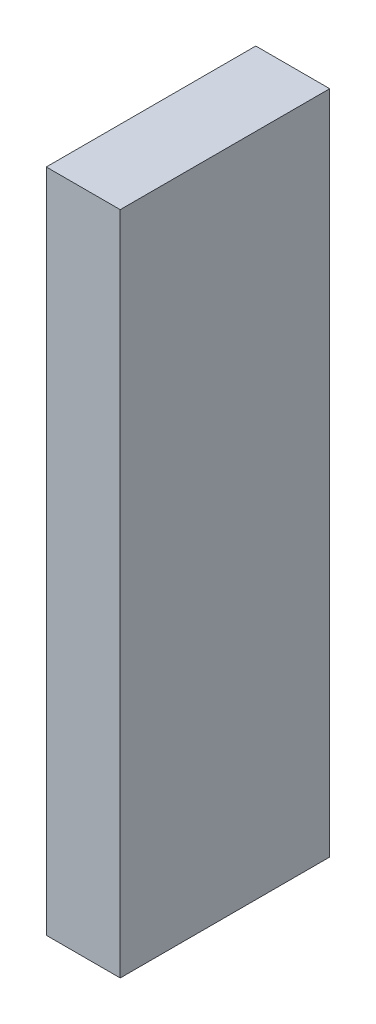
ISO-10303-21;
HEADER;
FILE_DESCRIPTION(('STEP AP214'),'2;1');
FILE_NAME('part.step','',(''),(''),'','','');
FILE_SCHEMA(('AUTOMOTIVE_DESIGN { 1 0 10303 214 1 1 1 1 }'));
ENDSEC;
DATA;
#1=APPLICATION_CONTEXT('core data for automotive mechanical design processes');
#2=APPLICATION_PROTOCOL_DEFINITION('international standard','automotive_design',2000,#1);
#3=PRODUCT_CONTEXT('',#1,'mechanical');
#4=PRODUCT('Part','Part','',(#3));
#5=PRODUCT_RELATED_PRODUCT_CATEGORY('part','',(#4));
#6=PRODUCT_DEFINITION_FORMATION('','',#4);
#7=PRODUCT_DEFINITION_CONTEXT('part definition',#1,'design');
#8=PRODUCT_DEFINITION('design','',#6,#7);
#9=PRODUCT_DEFINITION_SHAPE('','',#8);
#10=(LENGTH_UNIT() NAMED_UNIT(*) SI_UNIT(.MILLI.,.METRE.));
#11=(NAMED_UNIT(*) PLANE_ANGLE_UNIT() SI_UNIT($,.RADIAN.));
#12=(NAMED_UNIT(*) SI_UNIT($,.STERADIAN.) SOLID_ANGLE_UNIT());
#13=UNCERTAINTY_MEASURE_WITH_UNIT(LENGTH_MEASURE(1.E-05),#10,'distance_accuracy_value','');
#14=(GEOMETRIC_REPRESENTATION_CONTEXT(3) GLOBAL_UNCERTAINTY_ASSIGNED_CONTEXT((#13)) GLOBAL_UNIT_ASSIGNED_CONTEXT((#10,
#11,#12)) REPRESENTATION_CONTEXT('',''));
#15=CARTESIAN_POINT('',(0.,0.,0.));
#16=DIRECTION('',(0.,0.,1.));
#17=DIRECTION('',(1.,0.,0.));
#18=AXIS2_PLACEMENT_3D('',#15,#16,#17);
#19=CARTESIAN_POINT('',(2.44999649785187,2.7000129621743,0.));
#20=DIRECTION('',(-1.,1.19248806385031E-08,0.));
#21=DIRECTION('',(-1.19248806385031E-08,-1.,0.));
#22=AXIS2_PLACEMENT_3D('',#19,#20,#21);
#23=PLANE('',#22);
#24=DIRECTION('',(-1.19248806627069E-08,-1.,0.));
#25=VECTOR('',#24,1.);
#26=CARTESIAN_POINT('',(2.44999649785187,2.7000129621743,0.));
#27=LINE('',#26,#25);
#28=CARTESIAN_POINT('',(2.44999649785187,2.7000129621743,0.));
#29=VERTEX_POINT('',#28);
#30=CARTESIAN_POINT('',(2.44999643345759,-2.69998093431008,0.));
#31=VERTEX_POINT('',#30);
#32=EDGE_CURVE('E11',#29,#31,#27,.T.);
#33=ORIENTED_EDGE('',*,*,#32,.T.);
#34=DIRECTION('',(0.,0.,1.));
#35=VECTOR('',#34,1.);
#36=CARTESIAN_POINT('',(2.44999643345759,-2.69998093431008,0.));
#37=LINE('',#36,#35);
#38=CARTESIAN_POINT('',(2.44999643345759,-2.69998093431008,1.6999990940094));
#39=VERTEX_POINT('',#38);
#40=EDGE_CURVE('E88',#31,#39,#37,.T.);
#41=ORIENTED_EDGE('',*,*,#40,.T.);
#42=DIRECTION('',(-1.19248806627069E-08,-1.,0.));
#43=VECTOR('',#42,1.);
#44=CARTESIAN_POINT('',(2.44999649785187,2.7000129621743,1.6999990940094));
#45=LINE('',#44,#43);
#46=CARTESIAN_POINT('',(2.44999649785187,2.7000129621743,1.6999990940094));
#47=VERTEX_POINT('',#46);
#48=EDGE_CURVE('E83',#47,#39,#45,.T.);
#49=ORIENTED_EDGE('',*,*,#48,.F.);
#50=DIRECTION('',(0.,0.,1.));
#51=VECTOR('',#50,1.);
#52=CARTESIAN_POINT('',(2.44999649785187,2.70001296217432,0.));
#53=LINE('',#52,#51);
#54=EDGE_CURVE('E72',#29,#47,#53,.T.);
#55=ORIENTED_EDGE('',*,*,#54,.F.);
#56=EDGE_LOOP('',(#33,#41,#49,#55));
#57=FACE_BOUND('',#56,.T.);
#58=ADVANCED_FACE('F17',(#57),#23,.T.);
#59=CARTESIAN_POINT('',(2.44999643345759,-2.69998093431008,0.));
#60=DIRECTION('',(-1.19248806385031E-08,-1.,0.));
#61=DIRECTION('',(1.,-1.19248806385031E-08,0.));
#62=AXIS2_PLACEMENT_3D('',#59,#60,#61);
#63=PLANE('',#62);
#64=DIRECTION('',(1.,-1.1924880741852E-08,0.));
#65=VECTOR('',#64,1.);
#66=CARTESIAN_POINT('',(2.44999643345759,-2.69998093431008,0.));
#67=LINE('',#66,#65);
#68=CARTESIAN_POINT('',(3.04999872227595,-2.69998094146501,0.));
#69=VERTEX_POINT('',#68);
#70=EDGE_CURVE('E24',#31,#69,#67,.T.);
#71=ORIENTED_EDGE('',*,*,#70,.T.);
#72=DIRECTION('',(0.,0.,1.));
#73=VECTOR('',#72,1.);
#74=CARTESIAN_POINT('',(3.04999872227595,-2.69998094146503,0.));
#75=LINE('',#74,#73);
#76=CARTESIAN_POINT('',(3.04999872227595,-2.69998094146501,1.6999990940094));
#77=VERTEX_POINT('',#76);
#78=EDGE_CURVE('E85',#69,#77,#75,.T.);
#79=ORIENTED_EDGE('',*,*,#78,.T.);
#80=DIRECTION('',(1.,-1.1924880741852E-08,0.));
#81=VECTOR('',#80,1.);
#82=CARTESIAN_POINT('',(2.44999643345759,-2.69998093431008,1.6999990940094));
#83=LINE('',#82,#81);
#84=EDGE_CURVE('E66',#39,#77,#83,.T.);
#85=ORIENTED_EDGE('',*,*,#84,.F.);
#86=ORIENTED_EDGE('',*,*,#40,.F.);
#87=EDGE_LOOP('',(#71,#79,#85,#86));
#88=FACE_BOUND('',#87,.T.);
#89=ADVANCED_FACE('F89',(#88),#63,.T.);
#90=CARTESIAN_POINT('',(3.04999872227595,-2.69998094146501,0.));
#91=DIRECTION('',(1.,-1.19248806385031E-08,0.));
#92=DIRECTION('',(1.19248806385031E-08,1.,0.));
#93=AXIS2_PLACEMENT_3D('',#90,#91,#92);
#94=PLANE('',#93);
#95=DIRECTION('',(1.19248806627069E-08,1.,0.));
#96=VECTOR('',#95,1.);
#97=CARTESIAN_POINT('',(3.04999872227595,-2.69998094146501,0.));
#98=LINE('',#97,#96);
#99=CARTESIAN_POINT('',(3.04999878667023,2.70001295501936,0.));
#100=VERTEX_POINT('',#99);
#101=EDGE_CURVE('E62',#69,#100,#98,.T.);
#102=ORIENTED_EDGE('',*,*,#101,.T.);
#103=DIRECTION('',(0.,0.,1.));
#104=VECTOR('',#103,1.);
#105=CARTESIAN_POINT('',(3.04999878667023,2.70001295501936,0.));
#106=LINE('',#105,#104);
#107=CARTESIAN_POINT('',(3.04999878667023,2.70001295501936,1.6999990940094));
#108=VERTEX_POINT('',#107);
#109=EDGE_CURVE('E55',#100,#108,#106,.T.);
#110=ORIENTED_EDGE('',*,*,#109,.T.);
#111=DIRECTION('',(1.19248806627069E-08,1.,0.));
#112=VECTOR('',#111,1.);
#113=CARTESIAN_POINT('',(3.04999872227595,-2.69998094146501,1.6999990940094));
#114=LINE('',#113,#112);
#115=EDGE_CURVE('E59',#77,#108,#114,.T.);
#116=ORIENTED_EDGE('',*,*,#115,.F.);
#117=ORIENTED_EDGE('',*,*,#78,.F.);
#118=EDGE_LOOP('',(#102,#110,#116,#117));
#119=FACE_BOUND('',#118,.T.);
#120=ADVANCED_FACE('F57',(#119),#94,.T.);
#121=CARTESIAN_POINT('',(3.04999878667023,2.70001295501936,0.));
#122=DIRECTION('',(1.19248806385031E-08,1.,0.));
#123=DIRECTION('',(-1.,1.19248806385031E-08,0.));
#124=AXIS2_PLACEMENT_3D('',#121,#122,#123);
#125=PLANE('',#124);
#126=DIRECTION('',(-1.,1.1924880741852E-08,0.));
#127=VECTOR('',#126,1.);
#128=CARTESIAN_POINT('',(3.04999878667023,2.70001295501936,0.));
#129=LINE('',#128,#127);
#130=EDGE_CURVE('E65',#100,#29,#129,.T.);
#131=ORIENTED_EDGE('',*,*,#130,.T.);
#132=ORIENTED_EDGE('',*,*,#54,.T.);
#133=DIRECTION('',(-1.,1.1924880741852E-08,0.));
#134=VECTOR('',#133,1.);
#135=CARTESIAN_POINT('',(3.04999878667023,2.70001295501936,1.6999990940094));
#136=LINE('',#135,#134);
#137=EDGE_CURVE('E70',#108,#47,#136,.T.);
#138=ORIENTED_EDGE('',*,*,#137,.F.);
#139=ORIENTED_EDGE('',*,*,#109,.F.);
#140=EDGE_LOOP('',(#131,#132,#138,#139));
#141=FACE_BOUND('',#140,.T.);
#142=ADVANCED_FACE('F71',(#141),#125,.T.);
#143=CARTESIAN_POINT('',(65.7749938964844,-279.424987792969,1.6999990940094));
#144=DIRECTION('',(0.,0.,1.));
#145=DIRECTION('',(1.19248806385031E-08,1.,0.));
#146=AXIS2_PLACEMENT_3D('',#143,#144,#145);
#147=PLANE('',#146);
#148=ORIENTED_EDGE('',*,*,#48,.T.);
#149=ORIENTED_EDGE('',*,*,#84,.T.);
#150=ORIENTED_EDGE('',*,*,#115,.T.);
#151=ORIENTED_EDGE('',*,*,#137,.T.);
#152=EDGE_LOOP('',(#148,#149,#150,#151));
#153=FACE_BOUND('',#152,.T.);
#154=ADVANCED_FACE('F76',(#153),#147,.T.);
#155=CARTESIAN_POINT('',(65.7749938964844,-279.424987792969,0.));
#156=DIRECTION('',(0.,0.,1.));
#157=DIRECTION('',(1.19248806385031E-08,1.,0.));
#158=AXIS2_PLACEMENT_3D('',#155,#156,#157);
#159=PLANE('',#158);
#160=ORIENTED_EDGE('',*,*,#130,.F.);
#161=ORIENTED_EDGE('',*,*,#101,.F.);
#162=ORIENTED_EDGE('',*,*,#70,.F.);
#163=ORIENTED_EDGE('',*,*,#32,.F.);
#164=EDGE_LOOP('',(#160,#161,#162,#163));
#165=FACE_BOUND('',#164,.T.);
#166=ADVANCED_FACE('F91',(#165),#159,.F.);
#167=CLOSED_SHELL('',(#58,#89,#120,#142,#154,#166));
#168=MANIFOLD_SOLID_BREP('B1',#167);
#169=ADVANCED_BREP_SHAPE_REPRESENTATION('',(#18,#168),#14);
#170=SHAPE_DEFINITION_REPRESENTATION(#9,#169);
ENDSEC;
END-ISO-10303-21;
